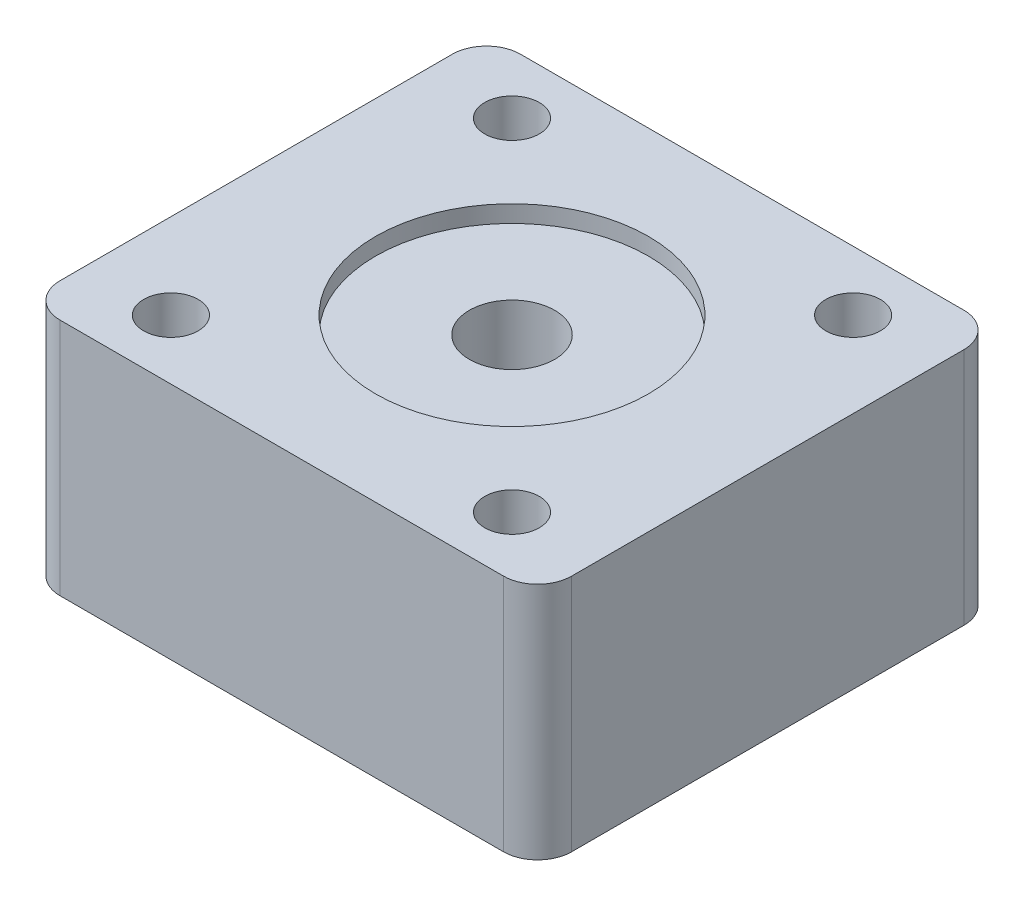
ISO-10303-21;
HEADER;
FILE_DESCRIPTION(('STEP AP214'),'2;1');
FILE_NAME('part.step','',(''),(''),'','','');
FILE_SCHEMA(('AUTOMOTIVE_DESIGN { 1 0 10303 214 1 1 1 1 }'));
ENDSEC;
DATA;
#1=APPLICATION_CONTEXT('core data for automotive mechanical design processes');
#2=APPLICATION_PROTOCOL_DEFINITION('international standard','automotive_design',2000,#1);
#3=PRODUCT_CONTEXT('',#1,'mechanical');
#4=PRODUCT('Part','Part','',(#3));
#5=PRODUCT_RELATED_PRODUCT_CATEGORY('part','',(#4));
#6=PRODUCT_DEFINITION_FORMATION('','',#4);
#7=PRODUCT_DEFINITION_CONTEXT('part definition',#1,'design');
#8=PRODUCT_DEFINITION('design','',#6,#7);
#9=PRODUCT_DEFINITION_SHAPE('','',#8);
#10=(LENGTH_UNIT() NAMED_UNIT(*) SI_UNIT(.MILLI.,.METRE.));
#11=(NAMED_UNIT(*) PLANE_ANGLE_UNIT() SI_UNIT($,.RADIAN.));
#12=(NAMED_UNIT(*) SI_UNIT($,.STERADIAN.) SOLID_ANGLE_UNIT());
#13=UNCERTAINTY_MEASURE_WITH_UNIT(LENGTH_MEASURE(1.E-05),#10,'distance_accuracy_value','');
#14=(GEOMETRIC_REPRESENTATION_CONTEXT(3) GLOBAL_UNCERTAINTY_ASSIGNED_CONTEXT((#13)) GLOBAL_UNIT_ASSIGNED_CONTEXT((#10,
#11,#12)) REPRESENTATION_CONTEXT('',''));
#15=CARTESIAN_POINT('',(0.,0.,0.));
#16=DIRECTION('',(0.,0.,1.));
#17=DIRECTION('',(1.,0.,0.));
#18=AXIS2_PLACEMENT_3D('',#15,#16,#17);
#19=CARTESIAN_POINT('',(0.,0.,0.));
#20=DIRECTION('',(0.,1.,0.));
#21=DIRECTION('',(0.,0.,1.));
#22=AXIS2_PLACEMENT_3D('',#19,#20,#21);
#23=CYLINDRICAL_SURFACE('',#22,2.5);
#24=CARTESIAN_POINT('',(0.,0.,0.));
#25=DIRECTION('',(0.,1.,0.));
#26=DIRECTION('',(0.,0.,1.));
#27=AXIS2_PLACEMENT_3D('',#24,#25,#26);
#28=CIRCLE('',#27,2.5);
#29=CARTESIAN_POINT('',(0.,0.,2.5));
#30=VERTEX_POINT('',#29);
#31=EDGE_CURVE('E145',#30,#30,#28,.T.);
#32=ORIENTED_EDGE('',*,*,#31,.F.);
#33=EDGE_LOOP('',(#32));
#34=FACE_BOUND('',#33,.T.);
#35=CARTESIAN_POINT('',(0.,13.,0.));
#36=DIRECTION('',(0.,1.,0.));
#37=DIRECTION('',(0.,0.,1.));
#38=AXIS2_PLACEMENT_3D('',#35,#36,#37);
#39=CIRCLE('',#38,2.5);
#40=CARTESIAN_POINT('',(0.,13.,2.5));
#41=VERTEX_POINT('',#40);
#42=EDGE_CURVE('E142',#41,#41,#39,.F.);
#43=ORIENTED_EDGE('',*,*,#42,.F.);
#44=EDGE_LOOP('',(#43));
#45=FACE_BOUND('',#44,.T.);
#46=ADVANCED_FACE('F40',(#34,#45),#23,.F.);
#47=CARTESIAN_POINT('',(0.,14.,0.));
#48=DIRECTION('',(0.,1.,0.));
#49=DIRECTION('',(0.,0.,1.));
#50=AXIS2_PLACEMENT_3D('',#47,#48,#49);
#51=PLANE('',#50);
#52=CARTESIAN_POINT('',(0.,14.,0.));
#53=DIRECTION('',(0.,1.,0.));
#54=DIRECTION('',(0.,0.,1.));
#55=AXIS2_PLACEMENT_3D('',#52,#53,#54);
#56=CIRCLE('',#55,8.);
#57=CARTESIAN_POINT('',(0.,14.,8.));
#58=VERTEX_POINT('',#57);
#59=EDGE_CURVE('E209',#58,#58,#56,.T.);
#60=ORIENTED_EDGE('',*,*,#59,.F.);
#61=EDGE_LOOP('',(#60));
#62=FACE_BOUND('',#61,.T.);
#63=CARTESIAN_POINT('',(10.,14.,10.));
#64=DIRECTION('',(0.,1.,0.));
#65=DIRECTION('',(0.,0.,1.));
#66=AXIS2_PLACEMENT_3D('',#63,#64,#65);
#67=CIRCLE('',#66,1.6);
#68=CARTESIAN_POINT('',(10.,14.,11.6));
#69=VERTEX_POINT('',#68);
#70=EDGE_CURVE('E193',#69,#69,#67,.T.);
#71=ORIENTED_EDGE('',*,*,#70,.F.);
#72=EDGE_LOOP('',(#71));
#73=FACE_BOUND('',#72,.T.);
#74=CARTESIAN_POINT('',(-10.,14.,-10.));
#75=DIRECTION('',(0.,1.,0.));
#76=DIRECTION('',(0.,0.,1.));
#77=AXIS2_PLACEMENT_3D('',#74,#75,#76);
#78=CIRCLE('',#77,1.6);
#79=CARTESIAN_POINT('',(-10.,14.,-8.4));
#80=VERTEX_POINT('',#79);
#81=EDGE_CURVE('E176',#80,#80,#78,.T.);
#82=ORIENTED_EDGE('',*,*,#81,.F.);
#83=EDGE_LOOP('',(#82));
#84=FACE_BOUND('',#83,.T.);
#85=DIRECTION('',(0.,0.,1.));
#86=VECTOR('',#85,1.);
#87=CARTESIAN_POINT('',(-15.,14.,-13.5));
#88=LINE('',#87,#86);
#89=CARTESIAN_POINT('',(-15.,14.,-11.5));
#90=VERTEX_POINT('',#89);
#91=CARTESIAN_POINT('',(-15.,14.,11.5));
#92=VERTEX_POINT('',#91);
#93=EDGE_CURVE('E183',#90,#92,#88,.T.);
#94=ORIENTED_EDGE('',*,*,#93,.T.);
#95=CARTESIAN_POINT('',(-13.,14.,11.5));
#96=DIRECTION('',(0.,1.,0.));
#97=DIRECTION('',(0.,0.,1.));
#98=AXIS2_PLACEMENT_3D('',#95,#96,#97);
#99=CIRCLE('',#98,2.);
#100=CARTESIAN_POINT('',(-13.,14.,13.5));
#101=VERTEX_POINT('',#100);
#102=EDGE_CURVE('E160',#92,#101,#99,.T.);
#103=ORIENTED_EDGE('',*,*,#102,.T.);
#104=DIRECTION('',(1.,0.,0.));
#105=VECTOR('',#104,1.);
#106=CARTESIAN_POINT('',(-15.,14.,13.5));
#107=LINE('',#106,#105);
#108=CARTESIAN_POINT('',(13.,14.,13.5));
#109=VERTEX_POINT('',#108);
#110=EDGE_CURVE('E126',#101,#109,#107,.T.);
#111=ORIENTED_EDGE('',*,*,#110,.T.);
#112=CARTESIAN_POINT('',(13.,14.,11.5));
#113=DIRECTION('',(0.,1.,0.));
#114=DIRECTION('',(0.,0.,1.));
#115=AXIS2_PLACEMENT_3D('',#112,#113,#114);
#116=CIRCLE('',#115,2.);
#117=CARTESIAN_POINT('',(15.,14.,11.5));
#118=VERTEX_POINT('',#117);
#119=EDGE_CURVE('E155',#109,#118,#116,.T.);
#120=ORIENTED_EDGE('',*,*,#119,.T.);
#121=DIRECTION('',(0.,0.,-1.));
#122=VECTOR('',#121,1.);
#123=CARTESIAN_POINT('',(15.,14.,-13.5));
#124=LINE('',#123,#122);
#125=CARTESIAN_POINT('',(15.,14.,-11.5));
#126=VERTEX_POINT('',#125);
#127=EDGE_CURVE('E133',#118,#126,#124,.T.);
#128=ORIENTED_EDGE('',*,*,#127,.T.);
#129=CARTESIAN_POINT('',(13.,14.,-11.5));
#130=DIRECTION('',(0.,1.,0.));
#131=DIRECTION('',(0.,0.,1.));
#132=AXIS2_PLACEMENT_3D('',#129,#130,#131);
#133=CIRCLE('',#132,2.);
#134=CARTESIAN_POINT('',(13.,14.,-13.5));
#135=VERTEX_POINT('',#134);
#136=EDGE_CURVE('E62',#126,#135,#133,.T.);
#137=ORIENTED_EDGE('',*,*,#136,.T.);
#138=DIRECTION('',(-1.,0.,0.));
#139=VECTOR('',#138,1.);
#140=CARTESIAN_POINT('',(-15.,14.,-13.5));
#141=LINE('',#140,#139);
#142=CARTESIAN_POINT('',(-13.,14.,-13.5));
#143=VERTEX_POINT('',#142);
#144=EDGE_CURVE('E136',#135,#143,#141,.T.);
#145=ORIENTED_EDGE('',*,*,#144,.T.);
#146=CARTESIAN_POINT('',(-13.,14.,-11.5));
#147=DIRECTION('',(0.,1.,0.));
#148=DIRECTION('',(0.,0.,1.));
#149=AXIS2_PLACEMENT_3D('',#146,#147,#148);
#150=CIRCLE('',#149,2.);
#151=EDGE_CURVE('E158',#143,#90,#150,.T.);
#152=ORIENTED_EDGE('',*,*,#151,.T.);
#153=EDGE_LOOP('',(#94,#103,#111,#120,#128,#137,#145,#152));
#154=FACE_BOUND('',#153,.T.);
#155=CARTESIAN_POINT('',(10.,14.,-10.));
#156=DIRECTION('',(0.,1.,0.));
#157=DIRECTION('',(0.,0.,1.));
#158=AXIS2_PLACEMENT_3D('',#155,#156,#157);
#159=CIRCLE('',#158,1.6);
#160=CARTESIAN_POINT('',(10.,14.,-8.4));
#161=VERTEX_POINT('',#160);
#162=EDGE_CURVE('E188',#161,#161,#159,.T.);
#163=ORIENTED_EDGE('',*,*,#162,.F.);
#164=EDGE_LOOP('',(#163));
#165=FACE_BOUND('',#164,.T.);
#166=CARTESIAN_POINT('',(-10.,14.,10.));
#167=DIRECTION('',(0.,1.,0.));
#168=DIRECTION('',(0.,0.,1.));
#169=AXIS2_PLACEMENT_3D('',#166,#167,#168);
#170=CIRCLE('',#169,1.6);
#171=CARTESIAN_POINT('',(-10.,14.,11.6));
#172=VERTEX_POINT('',#171);
#173=EDGE_CURVE('E199',#172,#172,#170,.T.);
#174=ORIENTED_EDGE('',*,*,#173,.F.);
#175=EDGE_LOOP('',(#174));
#176=FACE_BOUND('',#175,.T.);
#177=ADVANCED_FACE('F224',(#62,#73,#84,#154,#165,#176),#51,.T.);
#178=CARTESIAN_POINT('',(0.,0.,0.));
#179=DIRECTION('',(0.,1.,0.));
#180=DIRECTION('',(0.,0.,1.));
#181=AXIS2_PLACEMENT_3D('',#178,#179,#180);
#182=PLANE('',#181);
#183=ORIENTED_EDGE('',*,*,#31,.T.);
#184=EDGE_LOOP('',(#183));
#185=FACE_BOUND('',#184,.T.);
#186=DIRECTION('',(1.,0.,0.));
#187=VECTOR('',#186,1.);
#188=CARTESIAN_POINT('',(-15.,0.,13.5));
#189=LINE('',#188,#187);
#190=CARTESIAN_POINT('',(-13.,0.,13.5));
#191=VERTEX_POINT('',#190);
#192=CARTESIAN_POINT('',(13.,0.,13.5));
#193=VERTEX_POINT('',#192);
#194=EDGE_CURVE('E123',#191,#193,#189,.T.);
#195=ORIENTED_EDGE('',*,*,#194,.F.);
#196=CARTESIAN_POINT('',(-13.,0.,11.5));
#197=DIRECTION('',(0.,1.,0.));
#198=DIRECTION('',(0.,0.,1.));
#199=AXIS2_PLACEMENT_3D('',#196,#197,#198);
#200=CIRCLE('',#199,2.);
#201=CARTESIAN_POINT('',(-15.,0.,11.5));
#202=VERTEX_POINT('',#201);
#203=EDGE_CURVE('E106',#191,#202,#200,.F.);
#204=ORIENTED_EDGE('',*,*,#203,.T.);
#205=DIRECTION('',(0.,0.,1.));
#206=VECTOR('',#205,1.);
#207=CARTESIAN_POINT('',(-15.,0.,-13.5));
#208=LINE('',#207,#206);
#209=CARTESIAN_POINT('',(-15.,0.,-11.5));
#210=VERTEX_POINT('',#209);
#211=EDGE_CURVE('E134',#210,#202,#208,.T.);
#212=ORIENTED_EDGE('',*,*,#211,.F.);
#213=CARTESIAN_POINT('',(-13.,0.,-11.5));
#214=DIRECTION('',(0.,1.,0.));
#215=DIRECTION('',(0.,0.,1.));
#216=AXIS2_PLACEMENT_3D('',#213,#214,#215);
#217=CIRCLE('',#216,2.);
#218=CARTESIAN_POINT('',(-13.,0.,-13.5));
#219=VERTEX_POINT('',#218);
#220=EDGE_CURVE('E117',#210,#219,#217,.F.);
#221=ORIENTED_EDGE('',*,*,#220,.T.);
#222=DIRECTION('',(-1.,0.,0.));
#223=VECTOR('',#222,1.);
#224=CARTESIAN_POINT('',(-15.,0.,-13.5));
#225=LINE('',#224,#223);
#226=CARTESIAN_POINT('',(13.,0.,-13.5));
#227=VERTEX_POINT('',#226);
#228=EDGE_CURVE('E138',#227,#219,#225,.T.);
#229=ORIENTED_EDGE('',*,*,#228,.F.);
#230=CARTESIAN_POINT('',(13.,0.,-11.5));
#231=DIRECTION('',(0.,1.,0.));
#232=DIRECTION('',(0.,0.,1.));
#233=AXIS2_PLACEMENT_3D('',#230,#231,#232);
#234=CIRCLE('',#233,2.);
#235=CARTESIAN_POINT('',(15.,0.,-11.5));
#236=VERTEX_POINT('',#235);
#237=EDGE_CURVE('E149',#227,#236,#234,.F.);
#238=ORIENTED_EDGE('',*,*,#237,.T.);
#239=DIRECTION('',(0.,0.,-1.));
#240=VECTOR('',#239,1.);
#241=CARTESIAN_POINT('',(15.,0.,-13.5));
#242=LINE('',#241,#240);
#243=CARTESIAN_POINT('',(15.,0.,11.5));
#244=VERTEX_POINT('',#243);
#245=EDGE_CURVE('E171',#244,#236,#242,.T.);
#246=ORIENTED_EDGE('',*,*,#245,.F.);
#247=CARTESIAN_POINT('',(13.,0.,11.5));
#248=DIRECTION('',(0.,1.,0.));
#249=DIRECTION('',(0.,0.,1.));
#250=AXIS2_PLACEMENT_3D('',#247,#248,#249);
#251=CIRCLE('',#250,2.);
#252=EDGE_CURVE('E127',#244,#193,#251,.F.);
#253=ORIENTED_EDGE('',*,*,#252,.T.);
#254=EDGE_LOOP('',(#195,#204,#212,#221,#229,#238,#246,#253));
#255=FACE_BOUND('',#254,.T.);
#256=CARTESIAN_POINT('',(-10.,0.,-10.));
#257=DIRECTION('',(0.,1.,0.));
#258=DIRECTION('',(0.,0.,1.));
#259=AXIS2_PLACEMENT_3D('',#256,#257,#258);
#260=CIRCLE('',#259,1.6);
#261=CARTESIAN_POINT('',(-10.,0.,-8.4));
#262=VERTEX_POINT('',#261);
#263=EDGE_CURVE('E179',#262,#262,#260,.T.);
#264=ORIENTED_EDGE('',*,*,#263,.T.);
#265=EDGE_LOOP('',(#264));
#266=FACE_BOUND('',#265,.T.);
#267=CARTESIAN_POINT('',(10.,0.,-10.));
#268=DIRECTION('',(0.,1.,0.));
#269=DIRECTION('',(0.,0.,1.));
#270=AXIS2_PLACEMENT_3D('',#267,#268,#269);
#271=CIRCLE('',#270,1.6);
#272=CARTESIAN_POINT('',(10.,0.,-8.4));
#273=VERTEX_POINT('',#272);
#274=EDGE_CURVE('E190',#273,#273,#271,.T.);
#275=ORIENTED_EDGE('',*,*,#274,.T.);
#276=EDGE_LOOP('',(#275));
#277=FACE_BOUND('',#276,.T.);
#278=CARTESIAN_POINT('',(10.,0.,10.));
#279=DIRECTION('',(0.,1.,0.));
#280=DIRECTION('',(0.,0.,1.));
#281=AXIS2_PLACEMENT_3D('',#278,#279,#280);
#282=CIRCLE('',#281,1.6);
#283=CARTESIAN_POINT('',(10.,0.,11.6));
#284=VERTEX_POINT('',#283);
#285=EDGE_CURVE('E196',#284,#284,#282,.T.);
#286=ORIENTED_EDGE('',*,*,#285,.T.);
#287=EDGE_LOOP('',(#286));
#288=FACE_BOUND('',#287,.T.);
#289=CARTESIAN_POINT('',(-10.,0.,10.));
#290=DIRECTION('',(0.,1.,0.));
#291=DIRECTION('',(0.,0.,1.));
#292=AXIS2_PLACEMENT_3D('',#289,#290,#291);
#293=CIRCLE('',#292,1.6);
#294=CARTESIAN_POINT('',(-10.,0.,11.6));
#295=VERTEX_POINT('',#294);
#296=EDGE_CURVE('E202',#295,#295,#293,.T.);
#297=ORIENTED_EDGE('',*,*,#296,.T.);
#298=EDGE_LOOP('',(#297));
#299=FACE_BOUND('',#298,.T.);
#300=ADVANCED_FACE('F130',(#185,#255,#266,#277,#288,#299),#182,.F.);
#301=CARTESIAN_POINT('',(15.,14.,-13.5));
#302=DIRECTION('',(-1.,0.,0.));
#303=DIRECTION('',(0.,0.,1.));
#304=AXIS2_PLACEMENT_3D('',#301,#302,#303);
#305=PLANE('',#304);
#306=ORIENTED_EDGE('',*,*,#245,.T.);
#307=DIRECTION('',(0.,-1.,0.));
#308=VECTOR('',#307,1.);
#309=CARTESIAN_POINT('',(15.,14.,-11.5));
#310=LINE('',#309,#308);
#311=EDGE_CURVE('E11',#236,#126,#310,.F.);
#312=ORIENTED_EDGE('',*,*,#311,.T.);
#313=ORIENTED_EDGE('',*,*,#127,.F.);
#314=DIRECTION('',(0.,-1.,0.));
#315=VECTOR('',#314,1.);
#316=CARTESIAN_POINT('',(15.,14.,11.5));
#317=LINE('',#316,#315);
#318=EDGE_CURVE('E48',#118,#244,#317,.T.);
#319=ORIENTED_EDGE('',*,*,#318,.T.);
#320=EDGE_LOOP('',(#306,#312,#313,#319));
#321=FACE_BOUND('',#320,.T.);
#322=ADVANCED_FACE('F170',(#321),#305,.F.);
#323=CARTESIAN_POINT('',(-15.,14.,-13.5));
#324=DIRECTION('',(0.,0.,1.));
#325=DIRECTION('',(1.,0.,0.));
#326=AXIS2_PLACEMENT_3D('',#323,#324,#325);
#327=PLANE('',#326);
#328=ORIENTED_EDGE('',*,*,#228,.T.);
#329=DIRECTION('',(0.,-1.,0.));
#330=VECTOR('',#329,1.);
#331=CARTESIAN_POINT('',(-13.,14.,-13.5));
#332=LINE('',#331,#330);
#333=EDGE_CURVE('E55',#219,#143,#332,.F.);
#334=ORIENTED_EDGE('',*,*,#333,.T.);
#335=ORIENTED_EDGE('',*,*,#144,.F.);
#336=DIRECTION('',(0.,-1.,0.));
#337=VECTOR('',#336,1.);
#338=CARTESIAN_POINT('',(13.,14.,-13.5));
#339=LINE('',#338,#337);
#340=EDGE_CURVE('E162',#135,#227,#339,.T.);
#341=ORIENTED_EDGE('',*,*,#340,.T.);
#342=EDGE_LOOP('',(#328,#334,#335,#341));
#343=FACE_BOUND('',#342,.T.);
#344=ADVANCED_FACE('F250',(#343),#327,.F.);
#345=CARTESIAN_POINT('',(-15.,14.,-13.5));
#346=DIRECTION('',(1.,0.,0.));
#347=DIRECTION('',(0.,0.,-1.));
#348=AXIS2_PLACEMENT_3D('',#345,#346,#347);
#349=PLANE('',#348);
#350=ORIENTED_EDGE('',*,*,#211,.T.);
#351=DIRECTION('',(0.,-1.,0.));
#352=VECTOR('',#351,1.);
#353=CARTESIAN_POINT('',(-15.,14.,11.5));
#354=LINE('',#353,#352);
#355=EDGE_CURVE('E111',#202,#92,#354,.F.);
#356=ORIENTED_EDGE('',*,*,#355,.T.);
#357=ORIENTED_EDGE('',*,*,#93,.F.);
#358=DIRECTION('',(0.,-1.,0.));
#359=VECTOR('',#358,1.);
#360=CARTESIAN_POINT('',(-15.,14.,-11.5));
#361=LINE('',#360,#359);
#362=EDGE_CURVE('E116',#90,#210,#361,.T.);
#363=ORIENTED_EDGE('',*,*,#362,.T.);
#364=EDGE_LOOP('',(#350,#356,#357,#363));
#365=FACE_BOUND('',#364,.T.);
#366=ADVANCED_FACE('F275',(#365),#349,.F.);
#367=CARTESIAN_POINT('',(-15.,14.,13.5));
#368=DIRECTION('',(0.,0.,-1.));
#369=DIRECTION('',(-1.,0.,0.));
#370=AXIS2_PLACEMENT_3D('',#367,#368,#369);
#371=PLANE('',#370);
#372=ORIENTED_EDGE('',*,*,#110,.F.);
#373=DIRECTION('',(0.,-1.,0.));
#374=VECTOR('',#373,1.);
#375=CARTESIAN_POINT('',(-13.,14.,13.5));
#376=LINE('',#375,#374);
#377=EDGE_CURVE('E110',#101,#191,#376,.T.);
#378=ORIENTED_EDGE('',*,*,#377,.T.);
#379=ORIENTED_EDGE('',*,*,#194,.T.);
#380=DIRECTION('',(0.,-1.,0.));
#381=VECTOR('',#380,1.);
#382=CARTESIAN_POINT('',(13.,14.,13.5));
#383=LINE('',#382,#381);
#384=EDGE_CURVE('E128',#193,#109,#383,.F.);
#385=ORIENTED_EDGE('',*,*,#384,.T.);
#386=EDGE_LOOP('',(#372,#378,#379,#385));
#387=FACE_BOUND('',#386,.T.);
#388=ADVANCED_FACE('F122',(#387),#371,.F.);
#389=CARTESIAN_POINT('',(-10.,14.,-10.));
#390=DIRECTION('',(0.,-1.,0.));
#391=DIRECTION('',(0.,0.,-1.));
#392=AXIS2_PLACEMENT_3D('',#389,#390,#391);
#393=CYLINDRICAL_SURFACE('',#392,1.6);
#394=ORIENTED_EDGE('',*,*,#81,.T.);
#395=EDGE_LOOP('',(#394));
#396=FACE_BOUND('',#395,.T.);
#397=ORIENTED_EDGE('',*,*,#263,.F.);
#398=EDGE_LOOP('',(#397));
#399=FACE_BOUND('',#398,.T.);
#400=ADVANCED_FACE('F268',(#396,#399),#393,.F.);
#401=CARTESIAN_POINT('',(10.,14.,-10.));
#402=DIRECTION('',(0.,-1.,0.));
#403=DIRECTION('',(0.,0.,-1.));
#404=AXIS2_PLACEMENT_3D('',#401,#402,#403);
#405=CYLINDRICAL_SURFACE('',#404,1.6);
#406=ORIENTED_EDGE('',*,*,#162,.T.);
#407=EDGE_LOOP('',(#406));
#408=FACE_BOUND('',#407,.T.);
#409=ORIENTED_EDGE('',*,*,#274,.F.);
#410=EDGE_LOOP('',(#409));
#411=FACE_BOUND('',#410,.T.);
#412=ADVANCED_FACE('F264',(#408,#411),#405,.F.);
#413=CARTESIAN_POINT('',(10.,14.,10.));
#414=DIRECTION('',(0.,-1.,0.));
#415=DIRECTION('',(0.,0.,-1.));
#416=AXIS2_PLACEMENT_3D('',#413,#414,#415);
#417=CYLINDRICAL_SURFACE('',#416,1.6);
#418=ORIENTED_EDGE('',*,*,#70,.T.);
#419=EDGE_LOOP('',(#418));
#420=FACE_BOUND('',#419,.T.);
#421=ORIENTED_EDGE('',*,*,#285,.F.);
#422=EDGE_LOOP('',(#421));
#423=FACE_BOUND('',#422,.T.);
#424=ADVANCED_FACE('F240',(#420,#423),#417,.F.);
#425=CARTESIAN_POINT('',(-10.,14.,10.));
#426=DIRECTION('',(0.,-1.,0.));
#427=DIRECTION('',(0.,0.,-1.));
#428=AXIS2_PLACEMENT_3D('',#425,#426,#427);
#429=CYLINDRICAL_SURFACE('',#428,1.6);
#430=ORIENTED_EDGE('',*,*,#173,.T.);
#431=EDGE_LOOP('',(#430));
#432=FACE_BOUND('',#431,.T.);
#433=ORIENTED_EDGE('',*,*,#296,.F.);
#434=EDGE_LOOP('',(#433));
#435=FACE_BOUND('',#434,.T.);
#436=ADVANCED_FACE('F237',(#432,#435),#429,.F.);
#437=CARTESIAN_POINT('',(0.,13.,0.));
#438=DIRECTION('',(0.,1.,0.));
#439=DIRECTION('',(0.,0.,1.));
#440=AXIS2_PLACEMENT_3D('',#437,#438,#439);
#441=PLANE('',#440);
#442=CARTESIAN_POINT('',(0.,13.,0.));
#443=DIRECTION('',(0.,1.,0.));
#444=DIRECTION('',(0.,0.,1.));
#445=AXIS2_PLACEMENT_3D('',#442,#443,#444);
#446=CIRCLE('',#445,8.);
#447=CARTESIAN_POINT('',(0.,13.,8.));
#448=VERTEX_POINT('',#447);
#449=EDGE_CURVE('E146',#448,#448,#446,.T.);
#450=ORIENTED_EDGE('',*,*,#449,.T.);
#451=EDGE_LOOP('',(#450));
#452=FACE_BOUND('',#451,.T.);
#453=ORIENTED_EDGE('',*,*,#42,.T.);
#454=EDGE_LOOP('',(#453));
#455=FACE_BOUND('',#454,.T.);
#456=ADVANCED_FACE('F215',(#452,#455),#441,.T.);
#457=CARTESIAN_POINT('',(0.,13.,0.));
#458=DIRECTION('',(0.,1.,0.));
#459=DIRECTION('',(0.,0.,1.));
#460=AXIS2_PLACEMENT_3D('',#457,#458,#459);
#461=CYLINDRICAL_SURFACE('',#460,8.);
#462=ORIENTED_EDGE('',*,*,#449,.F.);
#463=EDGE_LOOP('',(#462));
#464=FACE_BOUND('',#463,.T.);
#465=ORIENTED_EDGE('',*,*,#59,.T.);
#466=EDGE_LOOP('',(#465));
#467=FACE_BOUND('',#466,.T.);
#468=ADVANCED_FACE('F218',(#464,#467),#461,.F.);
#469=CARTESIAN_POINT('',(-13.,14.,11.5));
#470=DIRECTION('',(0.,-1.,0.));
#471=DIRECTION('',(0.,0.,-1.));
#472=AXIS2_PLACEMENT_3D('',#469,#470,#471);
#473=CYLINDRICAL_SURFACE('',#472,2.);
#474=ORIENTED_EDGE('',*,*,#102,.F.);
#475=ORIENTED_EDGE('',*,*,#355,.F.);
#476=ORIENTED_EDGE('',*,*,#203,.F.);
#477=ORIENTED_EDGE('',*,*,#377,.F.);
#478=EDGE_LOOP('',(#474,#475,#476,#477));
#479=FACE_BOUND('',#478,.T.);
#480=ADVANCED_FACE('F109',(#479),#473,.T.);
#481=CARTESIAN_POINT('',(-13.,14.,-11.5));
#482=DIRECTION('',(0.,-1.,0.));
#483=DIRECTION('',(0.,0.,-1.));
#484=AXIS2_PLACEMENT_3D('',#481,#482,#483);
#485=CYLINDRICAL_SURFACE('',#484,2.);
#486=ORIENTED_EDGE('',*,*,#151,.F.);
#487=ORIENTED_EDGE('',*,*,#333,.F.);
#488=ORIENTED_EDGE('',*,*,#220,.F.);
#489=ORIENTED_EDGE('',*,*,#362,.F.);
#490=EDGE_LOOP('',(#486,#487,#488,#489));
#491=FACE_BOUND('',#490,.T.);
#492=ADVANCED_FACE('F294',(#491),#485,.T.);
#493=CARTESIAN_POINT('',(13.,14.,-11.5));
#494=DIRECTION('',(0.,-1.,0.));
#495=DIRECTION('',(0.,0.,-1.));
#496=AXIS2_PLACEMENT_3D('',#493,#494,#495);
#497=CYLINDRICAL_SURFACE('',#496,2.);
#498=ORIENTED_EDGE('',*,*,#136,.F.);
#499=ORIENTED_EDGE('',*,*,#311,.F.);
#500=ORIENTED_EDGE('',*,*,#237,.F.);
#501=ORIENTED_EDGE('',*,*,#340,.F.);
#502=EDGE_LOOP('',(#498,#499,#500,#501));
#503=FACE_BOUND('',#502,.T.);
#504=ADVANCED_FACE('F296',(#503),#497,.T.);
#505=CARTESIAN_POINT('',(13.,14.,11.5));
#506=DIRECTION('',(0.,-1.,0.));
#507=DIRECTION('',(0.,0.,-1.));
#508=AXIS2_PLACEMENT_3D('',#505,#506,#507);
#509=CYLINDRICAL_SURFACE('',#508,2.);
#510=ORIENTED_EDGE('',*,*,#119,.F.);
#511=ORIENTED_EDGE('',*,*,#384,.F.);
#512=ORIENTED_EDGE('',*,*,#252,.F.);
#513=ORIENTED_EDGE('',*,*,#318,.F.);
#514=EDGE_LOOP('',(#510,#511,#512,#513));
#515=FACE_BOUND('',#514,.T.);
#516=ADVANCED_FACE('F42',(#515),#509,.T.);
#517=CLOSED_SHELL('',(#46,#177,#300,#322,#344,#366,#388,#400,#412,#424,#436,#456,#468,#480,#492,
#504,#516));
#518=MANIFOLD_SOLID_BREP('B2',#517);
#519=ADVANCED_BREP_SHAPE_REPRESENTATION('',(#18,#518),#14);
#520=SHAPE_DEFINITION_REPRESENTATION(#9,#519);
ENDSEC;
END-ISO-10303-21;
